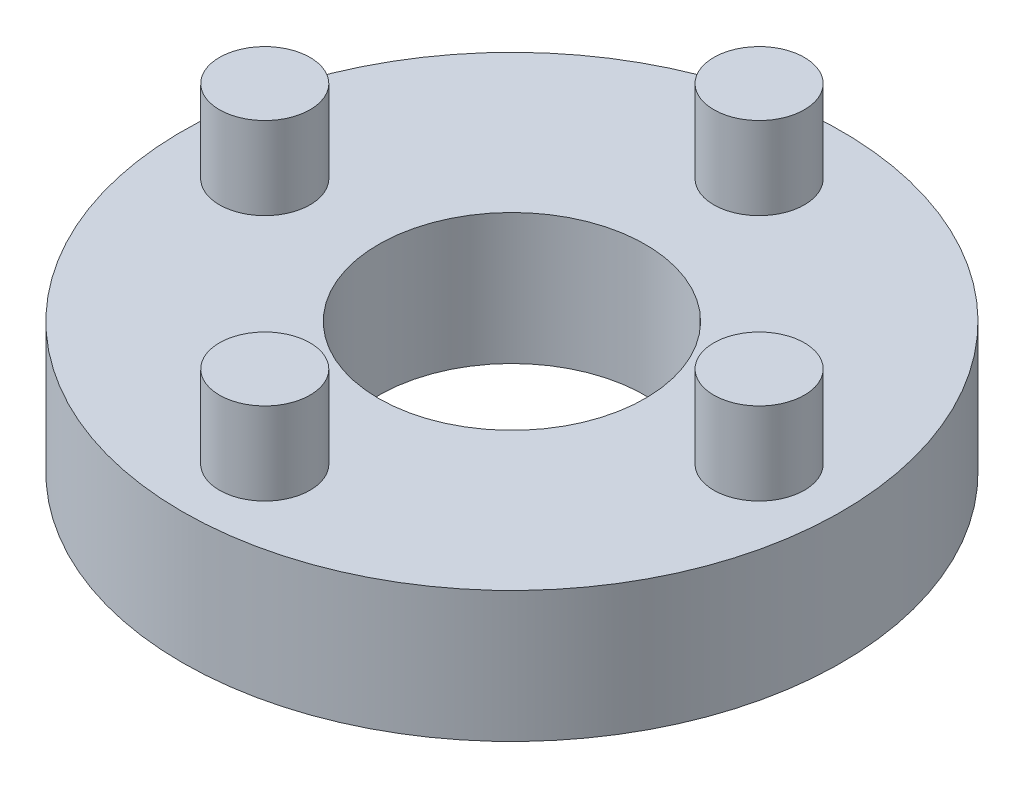
ISO-10303-21;
HEADER;
FILE_DESCRIPTION(('STEP AP214'),'2;1');
FILE_NAME('part.step','',(''),(''),'','','');
FILE_SCHEMA(('AUTOMOTIVE_DESIGN { 1 0 10303 214 1 1 1 1 }'));
ENDSEC;
DATA;
#1=APPLICATION_CONTEXT('core data for automotive mechanical design processes');
#2=APPLICATION_PROTOCOL_DEFINITION('international standard','automotive_design',2000,#1);
#3=PRODUCT_CONTEXT('',#1,'mechanical');
#4=PRODUCT('Part','Part','',(#3));
#5=PRODUCT_RELATED_PRODUCT_CATEGORY('part','',(#4));
#6=PRODUCT_DEFINITION_FORMATION('','',#4);
#7=PRODUCT_DEFINITION_CONTEXT('part definition',#1,'design');
#8=PRODUCT_DEFINITION('design','',#6,#7);
#9=PRODUCT_DEFINITION_SHAPE('','',#8);
#10=(LENGTH_UNIT() NAMED_UNIT(*) SI_UNIT(.MILLI.,.METRE.));
#11=(NAMED_UNIT(*) PLANE_ANGLE_UNIT() SI_UNIT($,.RADIAN.));
#12=(NAMED_UNIT(*) SI_UNIT($,.STERADIAN.) SOLID_ANGLE_UNIT());
#13=UNCERTAINTY_MEASURE_WITH_UNIT(LENGTH_MEASURE(1.E-05),#10,'distance_accuracy_value','');
#14=(GEOMETRIC_REPRESENTATION_CONTEXT(3) GLOBAL_UNCERTAINTY_ASSIGNED_CONTEXT((#13)) GLOBAL_UNIT_ASSIGNED_CONTEXT((#10,
#11,#12)) REPRESENTATION_CONTEXT('',''));
#15=CARTESIAN_POINT('',(0.,0.,0.));
#16=DIRECTION('',(0.,0.,1.));
#17=DIRECTION('',(1.,0.,0.));
#18=AXIS2_PLACEMENT_3D('',#15,#16,#17);
#19=CARTESIAN_POINT('',(0.,3.175,0.));
#20=DIRECTION('',(0.,1.,0.));
#21=DIRECTION('',(0.,0.,1.));
#22=AXIS2_PLACEMENT_3D('',#19,#20,#21);
#23=PLANE('',#22);
#24=CARTESIAN_POINT('',(-5.99999999999983,3.175,1.70530256582424E-13));
#25=DIRECTION('',(0.,1.,0.));
#26=DIRECTION('',(0.,0.,1.));
#27=AXIS2_PLACEMENT_3D('',#24,#25,#26);
#28=CIRCLE('',#27,1.10000000000027);
#29=CARTESIAN_POINT('',(-5.99999999999983,3.175,1.10000000000044));
#30=VERTEX_POINT('',#29);
#31=EDGE_CURVE('E67',#30,#30,#28,.T.);
#32=ORIENTED_EDGE('',*,*,#31,.F.);
#33=EDGE_LOOP('',(#32));
#34=FACE_BOUND('',#33,.T.);
#35=CARTESIAN_POINT('',(3.39590937005871E-13,3.175,6.));
#36=DIRECTION('',(0.,1.,0.));
#37=DIRECTION('',(0.,0.,1.));
#38=AXIS2_PLACEMENT_3D('',#35,#36,#37);
#39=CIRCLE('',#38,1.10000000000037);
#40=CARTESIAN_POINT('',(3.39590937005871E-13,3.175,7.10000000000037));
#41=VERTEX_POINT('',#40);
#42=EDGE_CURVE('E61',#41,#41,#39,.T.);
#43=ORIENTED_EDGE('',*,*,#42,.F.);
#44=EDGE_LOOP('',(#43));
#45=FACE_BOUND('',#44,.T.);
#46=CARTESIAN_POINT('',(6.00000000000017,3.175,-1.69795468502936E-13));
#47=DIRECTION('',(0.,1.,0.));
#48=DIRECTION('',(0.,0.,1.));
#49=AXIS2_PLACEMENT_3D('',#46,#47,#48);
#50=CIRCLE('',#49,1.10000000000013);
#51=CARTESIAN_POINT('',(6.00000000000017,3.175,1.09999999999996));
#52=VERTEX_POINT('',#51);
#53=EDGE_CURVE('E55',#52,#52,#50,.T.);
#54=ORIENTED_EDGE('',*,*,#53,.F.);
#55=EDGE_LOOP('',(#54));
#56=FACE_BOUND('',#55,.T.);
#57=CARTESIAN_POINT('',(0.,3.175,-6.));
#58=DIRECTION('',(0.,1.,0.));
#59=DIRECTION('',(0.,0.,1.));
#60=AXIS2_PLACEMENT_3D('',#57,#58,#59);
#61=CIRCLE('',#60,1.1);
#62=CARTESIAN_POINT('',(0.,3.175,-4.9));
#63=VERTEX_POINT('',#62);
#64=EDGE_CURVE('E49',#63,#63,#61,.T.);
#65=ORIENTED_EDGE('',*,*,#64,.F.);
#66=EDGE_LOOP('',(#65));
#67=FACE_BOUND('',#66,.T.);
#68=CARTESIAN_POINT('',(0.,3.175,0.));
#69=DIRECTION('',(0.,1.,0.));
#70=DIRECTION('',(0.,0.,1.));
#71=AXIS2_PLACEMENT_3D('',#68,#69,#70);
#72=CIRCLE('',#71,8.);
#73=CARTESIAN_POINT('',(0.,3.175,8.));
#74=VERTEX_POINT('',#73);
#75=EDGE_CURVE('E10',#74,#74,#72,.T.);
#76=ORIENTED_EDGE('',*,*,#75,.T.);
#77=EDGE_LOOP('',(#76));
#78=FACE_BOUND('',#77,.T.);
#79=CARTESIAN_POINT('',(0.,3.175,0.));
#80=DIRECTION('',(0.,1.,0.));
#81=DIRECTION('',(0.,0.,1.));
#82=AXIS2_PLACEMENT_3D('',#79,#80,#81);
#83=CIRCLE('',#82,3.2385);
#84=CARTESIAN_POINT('',(0.,3.175,3.2385));
#85=VERTEX_POINT('',#84);
#86=EDGE_CURVE('E41',#85,#85,#83,.T.);
#87=ORIENTED_EDGE('',*,*,#86,.F.);
#88=EDGE_LOOP('',(#87));
#89=FACE_BOUND('',#88,.T.);
#90=ADVANCED_FACE('F30',(#34,#45,#56,#67,#78,#89),#23,.T.);
#91=CARTESIAN_POINT('',(0.,0.,0.));
#92=DIRECTION('',(0.,1.,0.));
#93=DIRECTION('',(0.,0.,1.));
#94=AXIS2_PLACEMENT_3D('',#91,#92,#93);
#95=PLANE('',#94);
#96=CARTESIAN_POINT('',(0.,0.,0.));
#97=DIRECTION('',(0.,1.,0.));
#98=DIRECTION('',(0.,0.,1.));
#99=AXIS2_PLACEMENT_3D('',#96,#97,#98);
#100=CIRCLE('',#99,8.);
#101=CARTESIAN_POINT('',(0.,0.,8.));
#102=VERTEX_POINT('',#101);
#103=EDGE_CURVE('E34',#102,#102,#100,.T.);
#104=ORIENTED_EDGE('',*,*,#103,.F.);
#105=EDGE_LOOP('',(#104));
#106=FACE_BOUND('',#105,.T.);
#107=CARTESIAN_POINT('',(0.,0.,0.));
#108=DIRECTION('',(0.,1.,0.));
#109=DIRECTION('',(0.,0.,1.));
#110=AXIS2_PLACEMENT_3D('',#107,#108,#109);
#111=CIRCLE('',#110,3.2385);
#112=CARTESIAN_POINT('',(0.,0.,3.2385));
#113=VERTEX_POINT('',#112);
#114=EDGE_CURVE('E43',#113,#113,#111,.T.);
#115=ORIENTED_EDGE('',*,*,#114,.T.);
#116=EDGE_LOOP('',(#115));
#117=FACE_BOUND('',#116,.T.);
#118=ADVANCED_FACE('F84',(#106,#117),#95,.F.);
#119=CARTESIAN_POINT('',(0.,3.175,0.));
#120=DIRECTION('',(0.,-1.,0.));
#121=DIRECTION('',(0.,0.,-1.));
#122=AXIS2_PLACEMENT_3D('',#119,#120,#121);
#123=CYLINDRICAL_SURFACE('',#122,8.);
#124=ORIENTED_EDGE('',*,*,#75,.F.);
#125=EDGE_LOOP('',(#124));
#126=FACE_BOUND('',#125,.T.);
#127=ORIENTED_EDGE('',*,*,#103,.T.);
#128=EDGE_LOOP('',(#127));
#129=FACE_BOUND('',#128,.T.);
#130=ADVANCED_FACE('F32',(#126,#129),#123,.T.);
#131=CARTESIAN_POINT('',(0.,3.175,0.));
#132=DIRECTION('',(0.,-1.,0.));
#133=DIRECTION('',(0.,0.,-1.));
#134=AXIS2_PLACEMENT_3D('',#131,#132,#133);
#135=CYLINDRICAL_SURFACE('',#134,3.2385);
#136=ORIENTED_EDGE('',*,*,#86,.T.);
#137=EDGE_LOOP('',(#136));
#138=FACE_BOUND('',#137,.T.);
#139=ORIENTED_EDGE('',*,*,#114,.F.);
#140=EDGE_LOOP('',(#139));
#141=FACE_BOUND('',#140,.T.);
#142=ADVANCED_FACE('F94',(#138,#141),#135,.F.);
#143=CARTESIAN_POINT('',(0.,5.175,-6.));
#144=DIRECTION('',(0.,-1.,0.));
#145=DIRECTION('',(0.,0.,-1.));
#146=AXIS2_PLACEMENT_3D('',#143,#144,#145);
#147=CYLINDRICAL_SURFACE('',#146,1.1);
#148=CARTESIAN_POINT('',(0.,5.175,-6.));
#149=DIRECTION('',(0.,1.,0.));
#150=DIRECTION('',(0.,0.,1.));
#151=AXIS2_PLACEMENT_3D('',#148,#149,#150);
#152=CIRCLE('',#151,1.1);
#153=CARTESIAN_POINT('',(0.,5.175,-4.9));
#154=VERTEX_POINT('',#153);
#155=EDGE_CURVE('E46',#154,#154,#152,.T.);
#156=ORIENTED_EDGE('',*,*,#155,.F.);
#157=EDGE_LOOP('',(#156));
#158=FACE_BOUND('',#157,.T.);
#159=ORIENTED_EDGE('',*,*,#64,.T.);
#160=EDGE_LOOP('',(#159));
#161=FACE_BOUND('',#160,.T.);
#162=ADVANCED_FACE('F97',(#158,#161),#147,.T.);
#163=CARTESIAN_POINT('',(0.,5.175,-6.));
#164=DIRECTION('',(0.,1.,0.));
#165=DIRECTION('',(0.,0.,1.));
#166=AXIS2_PLACEMENT_3D('',#163,#164,#165);
#167=PLANE('',#166);
#168=ORIENTED_EDGE('',*,*,#155,.T.);
#169=EDGE_LOOP('',(#168));
#170=FACE_BOUND('',#169,.T.);
#171=ADVANCED_FACE('F111',(#170),#167,.T.);
#172=CARTESIAN_POINT('',(6.00000000000017,5.175,-1.69795468502936E-13));
#173=DIRECTION('',(0.,-1.,0.));
#174=DIRECTION('',(0.,0.,-1.));
#175=AXIS2_PLACEMENT_3D('',#172,#173,#174);
#176=CYLINDRICAL_SURFACE('',#175,1.10000000000013);
#177=CARTESIAN_POINT('',(6.00000000000017,5.175,-1.69795468502936E-13));
#178=DIRECTION('',(0.,1.,0.));
#179=DIRECTION('',(0.,0.,1.));
#180=AXIS2_PLACEMENT_3D('',#177,#178,#179);
#181=CIRCLE('',#180,1.10000000000013);
#182=CARTESIAN_POINT('',(6.00000000000017,5.175,1.09999999999996));
#183=VERTEX_POINT('',#182);
#184=EDGE_CURVE('E52',#183,#183,#181,.T.);
#185=ORIENTED_EDGE('',*,*,#184,.F.);
#186=EDGE_LOOP('',(#185));
#187=FACE_BOUND('',#186,.T.);
#188=ORIENTED_EDGE('',*,*,#53,.T.);
#189=EDGE_LOOP('',(#188));
#190=FACE_BOUND('',#189,.T.);
#191=ADVANCED_FACE('F115',(#187,#190),#176,.T.);
#192=CARTESIAN_POINT('',(6.00000000000017,5.175,-1.69795468502936E-13));
#193=DIRECTION('',(0.,1.,0.));
#194=DIRECTION('',(0.,0.,1.));
#195=AXIS2_PLACEMENT_3D('',#192,#193,#194);
#196=PLANE('',#195);
#197=ORIENTED_EDGE('',*,*,#184,.T.);
#198=EDGE_LOOP('',(#197));
#199=FACE_BOUND('',#198,.T.);
#200=ADVANCED_FACE('F119',(#199),#196,.T.);
#201=CARTESIAN_POINT('',(3.39590937005871E-13,5.175,6.));
#202=DIRECTION('',(0.,-1.,0.));
#203=DIRECTION('',(0.,0.,-1.));
#204=AXIS2_PLACEMENT_3D('',#201,#202,#203);
#205=CYLINDRICAL_SURFACE('',#204,1.10000000000037);
#206=CARTESIAN_POINT('',(3.39590937005871E-13,5.175,6.));
#207=DIRECTION('',(0.,1.,0.));
#208=DIRECTION('',(0.,0.,1.));
#209=AXIS2_PLACEMENT_3D('',#206,#207,#208);
#210=CIRCLE('',#209,1.10000000000037);
#211=CARTESIAN_POINT('',(3.39590937005871E-13,5.175,7.10000000000037));
#212=VERTEX_POINT('',#211);
#213=EDGE_CURVE('E58',#212,#212,#210,.T.);
#214=ORIENTED_EDGE('',*,*,#213,.F.);
#215=EDGE_LOOP('',(#214));
#216=FACE_BOUND('',#215,.T.);
#217=ORIENTED_EDGE('',*,*,#42,.T.);
#218=EDGE_LOOP('',(#217));
#219=FACE_BOUND('',#218,.T.);
#220=ADVANCED_FACE('F123',(#216,#219),#205,.T.);
#221=CARTESIAN_POINT('',(3.39590937005871E-13,5.175,6.));
#222=DIRECTION('',(0.,1.,0.));
#223=DIRECTION('',(0.,0.,1.));
#224=AXIS2_PLACEMENT_3D('',#221,#222,#223);
#225=PLANE('',#224);
#226=ORIENTED_EDGE('',*,*,#213,.T.);
#227=EDGE_LOOP('',(#226));
#228=FACE_BOUND('',#227,.T.);
#229=ADVANCED_FACE('F78',(#228),#225,.T.);
#230=CARTESIAN_POINT('',(-5.99999999999983,5.175,1.70530256582424E-13));
#231=DIRECTION('',(0.,-1.,0.));
#232=DIRECTION('',(0.,0.,-1.));
#233=AXIS2_PLACEMENT_3D('',#230,#231,#232);
#234=CYLINDRICAL_SURFACE('',#233,1.10000000000027);
#235=CARTESIAN_POINT('',(-5.99999999999983,5.175,1.70530256582424E-13));
#236=DIRECTION('',(0.,1.,0.));
#237=DIRECTION('',(0.,0.,1.));
#238=AXIS2_PLACEMENT_3D('',#235,#236,#237);
#239=CIRCLE('',#238,1.10000000000027);
#240=CARTESIAN_POINT('',(-5.99999999999983,5.175,1.10000000000044));
#241=VERTEX_POINT('',#240);
#242=EDGE_CURVE('E64',#241,#241,#239,.T.);
#243=ORIENTED_EDGE('',*,*,#242,.F.);
#244=EDGE_LOOP('',(#243));
#245=FACE_BOUND('',#244,.T.);
#246=ORIENTED_EDGE('',*,*,#31,.T.);
#247=EDGE_LOOP('',(#246));
#248=FACE_BOUND('',#247,.T.);
#249=ADVANCED_FACE('F75',(#245,#248),#234,.T.);
#250=CARTESIAN_POINT('',(-5.99999999999983,5.175,1.70530256582424E-13));
#251=DIRECTION('',(0.,1.,0.));
#252=DIRECTION('',(0.,0.,1.));
#253=AXIS2_PLACEMENT_3D('',#250,#251,#252);
#254=PLANE('',#253);
#255=ORIENTED_EDGE('',*,*,#242,.T.);
#256=EDGE_LOOP('',(#255));
#257=FACE_BOUND('',#256,.T.);
#258=ADVANCED_FACE('F73',(#257),#254,.T.);
#259=CLOSED_SHELL('',(#90,#118,#130,#142,#162,#171,#191,#200,#220,#229,#249,#258));
#260=MANIFOLD_SOLID_BREP('B2',#259);
#261=ADVANCED_BREP_SHAPE_REPRESENTATION('',(#18,#260),#14);
#262=SHAPE_DEFINITION_REPRESENTATION(#9,#261);
ENDSEC;
END-ISO-10303-21;
